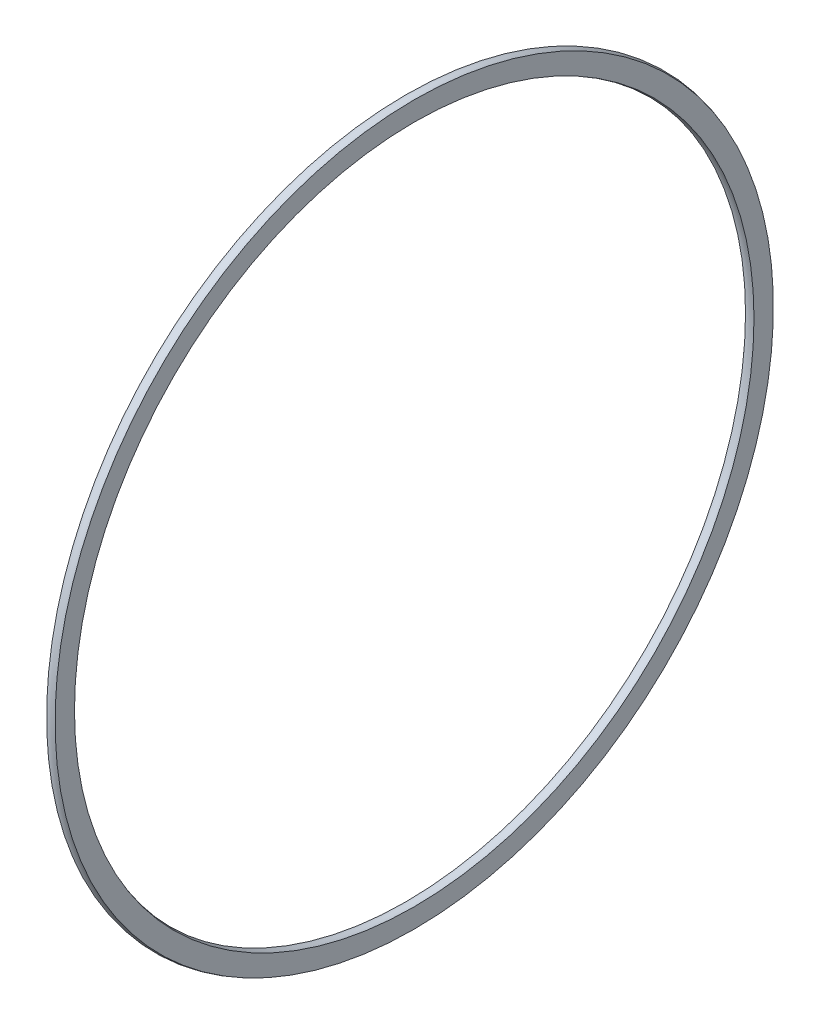
ISO-10303-21;
HEADER;
FILE_DESCRIPTION(('STEP AP214'),'2;1');
FILE_NAME('part.step','',(''),(''),'','','');
FILE_SCHEMA(('AUTOMOTIVE_DESIGN { 1 0 10303 214 1 1 1 1 }'));
ENDSEC;
DATA;
#1=APPLICATION_CONTEXT('core data for automotive mechanical design processes');
#2=APPLICATION_PROTOCOL_DEFINITION('international standard','automotive_design',2000,#1);
#3=PRODUCT_CONTEXT('',#1,'mechanical');
#4=PRODUCT('Part','Part','',(#3));
#5=PRODUCT_RELATED_PRODUCT_CATEGORY('part','',(#4));
#6=PRODUCT_DEFINITION_FORMATION('','',#4);
#7=PRODUCT_DEFINITION_CONTEXT('part definition',#1,'design');
#8=PRODUCT_DEFINITION('design','',#6,#7);
#9=PRODUCT_DEFINITION_SHAPE('','',#8);
#10=(LENGTH_UNIT() NAMED_UNIT(*) SI_UNIT(.MILLI.,.METRE.));
#11=(NAMED_UNIT(*) PLANE_ANGLE_UNIT() SI_UNIT($,.RADIAN.));
#12=(NAMED_UNIT(*) SI_UNIT($,.STERADIAN.) SOLID_ANGLE_UNIT());
#13=UNCERTAINTY_MEASURE_WITH_UNIT(LENGTH_MEASURE(1.E-05),#10,'distance_accuracy_value','');
#14=(GEOMETRIC_REPRESENTATION_CONTEXT(3) GLOBAL_UNCERTAINTY_ASSIGNED_CONTEXT((#13)) GLOBAL_UNIT_ASSIGNED_CONTEXT((#10,
#11,#12)) REPRESENTATION_CONTEXT('',''));
#15=CARTESIAN_POINT('',(0.,0.,0.));
#16=DIRECTION('',(0.,0.,1.));
#17=DIRECTION('',(1.,0.,0.));
#18=AXIS2_PLACEMENT_3D('',#15,#16,#17);
#19=CARTESIAN_POINT('',(0.199999999999989,0.,0.));
#20=DIRECTION('',(-1.,0.,0.));
#21=DIRECTION('',(0.,-1.,0.));
#22=AXIS2_PLACEMENT_3D('',#19,#20,#21);
#23=PLANE('',#22);
#24=CARTESIAN_POINT('',(0.199999999999989,0.,0.));
#25=DIRECTION('',(1.,0.,0.));
#26=DIRECTION('',(0.,1.,0.));
#27=AXIS2_PLACEMENT_3D('',#24,#25,#26);
#28=CIRCLE('',#27,16.0417423995895);
#29=CARTESIAN_POINT('',(0.199999999999987,16.0417423995895,0.));
#30=VERTEX_POINT('',#29);
#31=EDGE_CURVE('E57',#30,#30,#28,.T.);
#32=ORIENTED_EDGE('',*,*,#31,.F.);
#33=EDGE_LOOP('',(#32));
#34=FACE_BOUND('',#33,.T.);
#35=CARTESIAN_POINT('',(0.199999999999989,0.,0.));
#36=DIRECTION('',(1.,0.,0.));
#37=DIRECTION('',(0.,1.,0.));
#38=AXIS2_PLACEMENT_3D('',#35,#36,#37);
#39=CIRCLE('',#38,16.9582576084104);
#40=CARTESIAN_POINT('',(0.199999999999987,16.9582576084104,0.));
#41=VERTEX_POINT('',#40);
#42=EDGE_CURVE('E10',#41,#41,#39,.T.);
#43=ORIENTED_EDGE('',*,*,#42,.T.);
#44=EDGE_LOOP('',(#43));
#45=FACE_BOUND('',#44,.T.);
#46=ADVANCED_FACE('F39',(#34,#45),#23,.F.);
#47=CARTESIAN_POINT('',(0.,0.,0.));
#48=DIRECTION('',(1.,0.,0.));
#49=DIRECTION('',(0.,1.,0.));
#50=AXIS2_PLACEMENT_3D('',#47,#48,#49);
#51=TOROIDAL_SURFACE('',#50,16.500000004,0.500000031999998);
#52=CARTESIAN_POINT('',(-0.200000000000007,0.,0.));
#53=DIRECTION('',(1.,0.,0.));
#54=DIRECTION('',(0.,1.,0.));
#55=AXIS2_PLACEMENT_3D('',#52,#53,#54);
#56=CIRCLE('',#55,16.9582576084104);
#57=CARTESIAN_POINT('',(-0.200000000000009,16.9582576084104,0.));
#58=VERTEX_POINT('',#57);
#59=EDGE_CURVE('E46',#58,#58,#56,.T.);
#60=ORIENTED_EDGE('',*,*,#59,.T.);
#61=EDGE_LOOP('',(#60));
#62=FACE_BOUND('',#61,.T.);
#63=ORIENTED_EDGE('',*,*,#42,.F.);
#64=EDGE_LOOP('',(#63));
#65=FACE_BOUND('',#64,.T.);
#66=ADVANCED_FACE('F67',(#62,#65),#51,.T.);
#67=CARTESIAN_POINT('',(-0.200000000000007,0.,0.));
#68=DIRECTION('',(-1.,0.,0.));
#69=DIRECTION('',(0.,-1.,0.));
#70=AXIS2_PLACEMENT_3D('',#67,#68,#69);
#71=PLANE('',#70);
#72=CARTESIAN_POINT('',(-0.200000000000007,0.,0.));
#73=DIRECTION('',(1.,0.,0.));
#74=DIRECTION('',(0.,1.,0.));
#75=AXIS2_PLACEMENT_3D('',#72,#73,#74);
#76=CIRCLE('',#75,16.0417423995896);
#77=CARTESIAN_POINT('',(-0.200000000000009,16.0417423995896,0.));
#78=VERTEX_POINT('',#77);
#79=EDGE_CURVE('E52',#78,#78,#76,.T.);
#80=ORIENTED_EDGE('',*,*,#79,.T.);
#81=EDGE_LOOP('',(#80));
#82=FACE_BOUND('',#81,.T.);
#83=ORIENTED_EDGE('',*,*,#59,.F.);
#84=EDGE_LOOP('',(#83));
#85=FACE_BOUND('',#84,.T.);
#86=ADVANCED_FACE('F71',(#82,#85),#71,.T.);
#87=ORIENTED_EDGE('',*,*,#31,.T.);
#88=EDGE_LOOP('',(#87));
#89=FACE_BOUND('',#88,.T.);
#90=ORIENTED_EDGE('',*,*,#79,.F.);
#91=EDGE_LOOP('',(#90));
#92=FACE_BOUND('',#91,.T.);
#93=ADVANCED_FACE('F63',(#89,#92),#51,.T.);
#94=CLOSED_SHELL('',(#46,#66,#86,#93));
#95=MANIFOLD_SOLID_BREP('B2',#94);
#96=ADVANCED_BREP_SHAPE_REPRESENTATION('',(#18,#95),#14);
#97=SHAPE_DEFINITION_REPRESENTATION(#9,#96);
ENDSEC;
END-ISO-10303-21;
